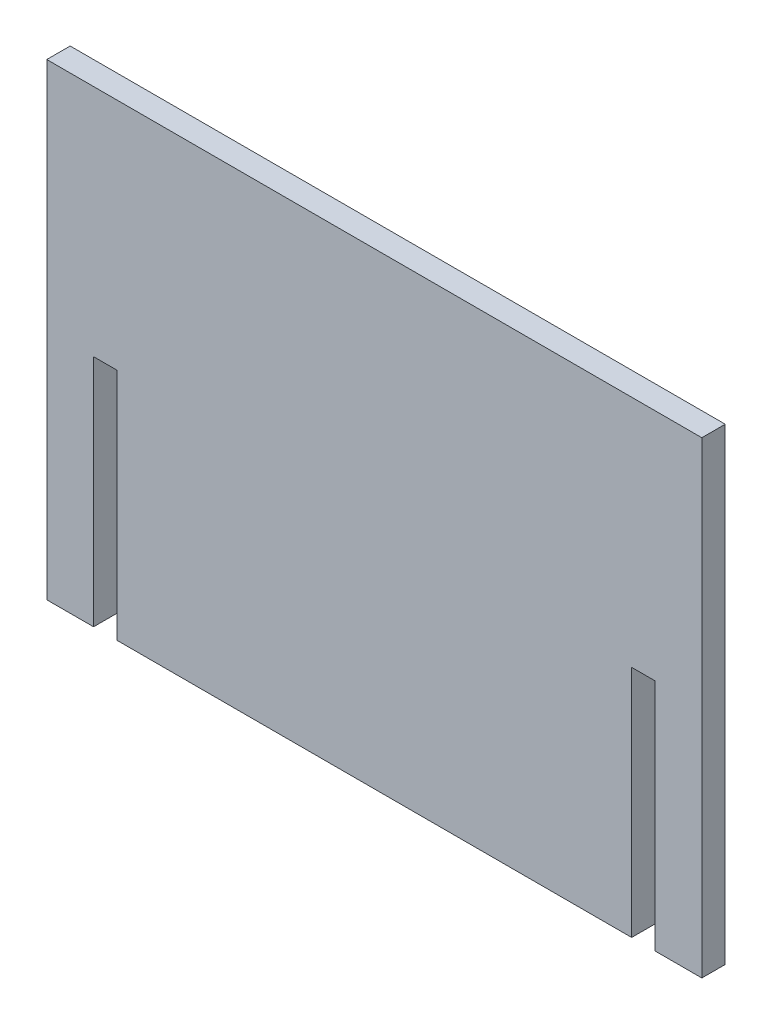
ISO-10303-21;
HEADER;
FILE_DESCRIPTION(('STEP AP214'),'2;1');
FILE_NAME('part.step','',(''),(''),'','','');
FILE_SCHEMA(('AUTOMOTIVE_DESIGN { 1 0 10303 214 1 1 1 1 }'));
ENDSEC;
DATA;
#1=APPLICATION_CONTEXT('core data for automotive mechanical design processes');
#2=APPLICATION_PROTOCOL_DEFINITION('international standard','automotive_design',2000,#1);
#3=PRODUCT_CONTEXT('',#1,'mechanical');
#4=PRODUCT('Part','Part','',(#3));
#5=PRODUCT_RELATED_PRODUCT_CATEGORY('part','',(#4));
#6=PRODUCT_DEFINITION_FORMATION('','',#4);
#7=PRODUCT_DEFINITION_CONTEXT('part definition',#1,'design');
#8=PRODUCT_DEFINITION('design','',#6,#7);
#9=PRODUCT_DEFINITION_SHAPE('','',#8);
#10=(LENGTH_UNIT() NAMED_UNIT(*) SI_UNIT(.MILLI.,.METRE.));
#11=(NAMED_UNIT(*) PLANE_ANGLE_UNIT() SI_UNIT($,.RADIAN.));
#12=(NAMED_UNIT(*) SI_UNIT($,.STERADIAN.) SOLID_ANGLE_UNIT());
#13=UNCERTAINTY_MEASURE_WITH_UNIT(LENGTH_MEASURE(1.E-05),#10,'distance_accuracy_value','');
#14=(GEOMETRIC_REPRESENTATION_CONTEXT(3) GLOBAL_UNCERTAINTY_ASSIGNED_CONTEXT((#13)) GLOBAL_UNIT_ASSIGNED_CONTEXT((#10,
#11,#12)) REPRESENTATION_CONTEXT('',''));
#15=CARTESIAN_POINT('',(0.,0.,0.));
#16=DIRECTION('',(0.,0.,1.));
#17=DIRECTION('',(1.,0.,0.));
#18=AXIS2_PLACEMENT_3D('',#15,#16,#17);
#19=CARTESIAN_POINT('',(1294.20395565763,-24.1798672236195,6.35));
#20=DIRECTION('',(1.,0.,0.));
#21=DIRECTION('',(0.,0.,-1.));
#22=AXIS2_PLACEMENT_3D('',#19,#20,#21);
#23=PLANE('',#22);
#24=DIRECTION('',(0.,-1.,0.));
#25=VECTOR('',#24,1.);
#26=CARTESIAN_POINT('',(1294.20395565763,-24.1798672236195,-6.35));
#27=LINE('',#26,#25);
#28=CARTESIAN_POINT('',(1294.20395565763,-24.1798672236195,-6.35));
#29=VERTEX_POINT('',#28);
#30=CARTESIAN_POINT('',(1294.20395565763,-278.17986722362,-6.35));
#31=VERTEX_POINT('',#30);
#32=EDGE_CURVE('E167',#29,#31,#27,.T.);
#33=ORIENTED_EDGE('',*,*,#32,.T.);
#34=DIRECTION('',(0.,0.,-1.));
#35=VECTOR('',#34,1.);
#36=CARTESIAN_POINT('',(1294.20395565763,-278.17986722362,6.35));
#37=LINE('',#36,#35);
#38=CARTESIAN_POINT('',(1294.20395565763,-278.17986722362,6.35));
#39=VERTEX_POINT('',#38);
#40=EDGE_CURVE('E11',#39,#31,#37,.T.);
#41=ORIENTED_EDGE('',*,*,#40,.F.);
#42=DIRECTION('',(0.,-1.,0.));
#43=VECTOR('',#42,1.);
#44=CARTESIAN_POINT('',(1294.20395565763,-24.1798672236195,6.35));
#45=LINE('',#44,#43);
#46=CARTESIAN_POINT('',(1294.20395565763,-24.1798672236195,6.35));
#47=VERTEX_POINT('',#46);
#48=EDGE_CURVE('E201',#47,#39,#45,.T.);
#49=ORIENTED_EDGE('',*,*,#48,.F.);
#50=DIRECTION('',(0.,0.,-1.));
#51=VECTOR('',#50,1.);
#52=CARTESIAN_POINT('',(1294.20395565763,-24.1798672236195,6.35));
#53=LINE('',#52,#51);
#54=EDGE_CURVE('E163',#47,#29,#53,.T.);
#55=ORIENTED_EDGE('',*,*,#54,.T.);
#56=EDGE_LOOP('',(#33,#41,#49,#55));
#57=FACE_BOUND('',#56,.T.);
#58=ADVANCED_FACE('F42',(#57),#23,.F.);
#59=CARTESIAN_POINT('',(1294.20395565763,-278.17986722362,6.35));
#60=DIRECTION('',(0.,1.,0.));
#61=DIRECTION('',(0.,0.,1.));
#62=AXIS2_PLACEMENT_3D('',#59,#60,#61);
#63=PLANE('',#62);
#64=DIRECTION('',(1.,0.,0.));
#65=VECTOR('',#64,1.);
#66=CARTESIAN_POINT('',(1294.20395565763,-278.17986722362,-6.35));
#67=LINE('',#66,#65);
#68=CARTESIAN_POINT('',(1319.60395565763,-278.17986722362,-6.35));
#69=VERTEX_POINT('',#68);
#70=EDGE_CURVE('E171',#31,#69,#67,.T.);
#71=ORIENTED_EDGE('',*,*,#70,.T.);
#72=DIRECTION('',(0.,0.,-1.));
#73=VECTOR('',#72,1.);
#74=CARTESIAN_POINT('',(1319.60395565763,-278.17986722362,6.35));
#75=LINE('',#74,#73);
#76=CARTESIAN_POINT('',(1319.60395565763,-278.17986722362,6.35));
#77=VERTEX_POINT('',#76);
#78=EDGE_CURVE('E51',#77,#69,#75,.T.);
#79=ORIENTED_EDGE('',*,*,#78,.F.);
#80=DIRECTION('',(1.,0.,0.));
#81=VECTOR('',#80,1.);
#82=CARTESIAN_POINT('',(1294.20395565763,-278.17986722362,6.35));
#83=LINE('',#82,#81);
#84=EDGE_CURVE('E114',#39,#77,#83,.T.);
#85=ORIENTED_EDGE('',*,*,#84,.F.);
#86=ORIENTED_EDGE('',*,*,#40,.T.);
#87=EDGE_LOOP('',(#71,#79,#85,#86));
#88=FACE_BOUND('',#87,.T.);
#89=ADVANCED_FACE('F295',(#88),#63,.F.);
#90=CARTESIAN_POINT('',(1319.60395565763,-278.17986722362,6.35));
#91=DIRECTION('',(-1.,0.,0.));
#92=DIRECTION('',(0.,0.,1.));
#93=AXIS2_PLACEMENT_3D('',#90,#91,#92);
#94=PLANE('',#93);
#95=DIRECTION('',(0.,1.,0.));
#96=VECTOR('',#95,1.);
#97=CARTESIAN_POINT('',(1319.60395565763,-278.17986722362,-6.35));
#98=LINE('',#97,#96);
#99=CARTESIAN_POINT('',(1319.60395565763,-151.17986722362,-6.35));
#100=VERTEX_POINT('',#99);
#101=EDGE_CURVE('E174',#69,#100,#98,.T.);
#102=ORIENTED_EDGE('',*,*,#101,.T.);
#103=DIRECTION('',(0.,0.,-1.));
#104=VECTOR('',#103,1.);
#105=CARTESIAN_POINT('',(1319.60395565763,-151.17986722362,6.35));
#106=LINE('',#105,#104);
#107=CARTESIAN_POINT('',(1319.60395565763,-151.17986722362,6.35));
#108=VERTEX_POINT('',#107);
#109=EDGE_CURVE('E228',#108,#100,#106,.T.);
#110=ORIENTED_EDGE('',*,*,#109,.F.);
#111=DIRECTION('',(0.,1.,0.));
#112=VECTOR('',#111,1.);
#113=CARTESIAN_POINT('',(1319.60395565763,-278.17986722362,6.35));
#114=LINE('',#113,#112);
#115=EDGE_CURVE('E238',#77,#108,#114,.T.);
#116=ORIENTED_EDGE('',*,*,#115,.F.);
#117=ORIENTED_EDGE('',*,*,#78,.T.);
#118=EDGE_LOOP('',(#102,#110,#116,#117));
#119=FACE_BOUND('',#118,.T.);
#120=ADVANCED_FACE('F236',(#119),#94,.F.);
#121=CARTESIAN_POINT('',(1319.60395565763,-151.17986722362,6.35));
#122=DIRECTION('',(0.,1.,0.));
#123=DIRECTION('',(0.,0.,1.));
#124=AXIS2_PLACEMENT_3D('',#121,#122,#123);
#125=PLANE('',#124);
#126=DIRECTION('',(1.,0.,0.));
#127=VECTOR('',#126,1.);
#128=CARTESIAN_POINT('',(1319.60395565763,-151.17986722362,-6.35));
#129=LINE('',#128,#127);
#130=CARTESIAN_POINT('',(1332.30395565763,-151.17986722362,-6.35));
#131=VERTEX_POINT('',#130);
#132=EDGE_CURVE('E177',#100,#131,#129,.T.);
#133=ORIENTED_EDGE('',*,*,#132,.T.);
#134=DIRECTION('',(0.,0.,-1.));
#135=VECTOR('',#134,1.);
#136=CARTESIAN_POINT('',(1332.30395565763,-151.17986722362,6.35));
#137=LINE('',#136,#135);
#138=CARTESIAN_POINT('',(1332.30395565763,-151.17986722362,6.35));
#139=VERTEX_POINT('',#138);
#140=EDGE_CURVE('E224',#139,#131,#137,.T.);
#141=ORIENTED_EDGE('',*,*,#140,.F.);
#142=DIRECTION('',(1.,0.,0.));
#143=VECTOR('',#142,1.);
#144=CARTESIAN_POINT('',(1319.60395565763,-151.17986722362,6.35));
#145=LINE('',#144,#143);
#146=EDGE_CURVE('E257',#108,#139,#145,.T.);
#147=ORIENTED_EDGE('',*,*,#146,.F.);
#148=ORIENTED_EDGE('',*,*,#109,.T.);
#149=EDGE_LOOP('',(#133,#141,#147,#148));
#150=FACE_BOUND('',#149,.T.);
#151=ADVANCED_FACE('F247',(#150),#125,.F.);
#152=CARTESIAN_POINT('',(1332.30395565763,-151.17986722362,6.35));
#153=DIRECTION('',(1.,0.,0.));
#154=DIRECTION('',(0.,0.,-1.));
#155=AXIS2_PLACEMENT_3D('',#152,#153,#154);
#156=PLANE('',#155);
#157=DIRECTION('',(0.,-1.,0.));
#158=VECTOR('',#157,1.);
#159=CARTESIAN_POINT('',(1332.30395565763,-151.17986722362,-6.35));
#160=LINE('',#159,#158);
#161=CARTESIAN_POINT('',(1332.30395565763,-278.17986722362,-6.35));
#162=VERTEX_POINT('',#161);
#163=EDGE_CURVE('E180',#131,#162,#160,.T.);
#164=ORIENTED_EDGE('',*,*,#163,.T.);
#165=DIRECTION('',(0.,0.,-1.));
#166=VECTOR('',#165,1.);
#167=CARTESIAN_POINT('',(1332.30395565763,-278.17986722362,6.35));
#168=LINE('',#167,#166);
#169=CARTESIAN_POINT('',(1332.30395565763,-278.17986722362,6.35));
#170=VERTEX_POINT('',#169);
#171=EDGE_CURVE('E220',#170,#162,#168,.T.);
#172=ORIENTED_EDGE('',*,*,#171,.F.);
#173=DIRECTION('',(0.,-1.,0.));
#174=VECTOR('',#173,1.);
#175=CARTESIAN_POINT('',(1332.30395565763,-151.17986722362,6.35));
#176=LINE('',#175,#174);
#177=EDGE_CURVE('E253',#139,#170,#176,.T.);
#178=ORIENTED_EDGE('',*,*,#177,.F.);
#179=ORIENTED_EDGE('',*,*,#140,.T.);
#180=EDGE_LOOP('',(#164,#172,#178,#179));
#181=FACE_BOUND('',#180,.T.);
#182=ADVANCED_FACE('F251',(#181),#156,.F.);
#183=CARTESIAN_POINT('',(1332.30395565763,-278.17986722362,6.35));
#184=DIRECTION('',(0.,1.,0.));
#185=DIRECTION('',(0.,0.,1.));
#186=AXIS2_PLACEMENT_3D('',#183,#184,#185);
#187=PLANE('',#186);
#188=DIRECTION('',(1.,0.,0.));
#189=VECTOR('',#188,1.);
#190=CARTESIAN_POINT('',(1332.30395565763,-278.17986722362,-6.35));
#191=LINE('',#190,#189);
#192=CARTESIAN_POINT('',(1611.70395565763,-278.17986722362,-6.35));
#193=VERTEX_POINT('',#192);
#194=EDGE_CURVE('E183',#162,#193,#191,.T.);
#195=ORIENTED_EDGE('',*,*,#194,.T.);
#196=DIRECTION('',(0.,0.,-1.));
#197=VECTOR('',#196,1.);
#198=CARTESIAN_POINT('',(1611.70395565763,-278.17986722362,6.35));
#199=LINE('',#198,#197);
#200=CARTESIAN_POINT('',(1611.70395565763,-278.17986722362,6.35));
#201=VERTEX_POINT('',#200);
#202=EDGE_CURVE('E216',#201,#193,#199,.T.);
#203=ORIENTED_EDGE('',*,*,#202,.F.);
#204=DIRECTION('',(1.,0.,0.));
#205=VECTOR('',#204,1.);
#206=CARTESIAN_POINT('',(1332.30395565763,-278.17986722362,6.35));
#207=LINE('',#206,#205);
#208=EDGE_CURVE('E256',#170,#201,#207,.T.);
#209=ORIENTED_EDGE('',*,*,#208,.F.);
#210=ORIENTED_EDGE('',*,*,#171,.T.);
#211=EDGE_LOOP('',(#195,#203,#209,#210));
#212=FACE_BOUND('',#211,.T.);
#213=ADVANCED_FACE('F308',(#212),#187,.F.);
#214=CARTESIAN_POINT('',(1611.70395565763,-278.17986722362,6.35));
#215=DIRECTION('',(-1.,0.,0.));
#216=DIRECTION('',(0.,0.,1.));
#217=AXIS2_PLACEMENT_3D('',#214,#215,#216);
#218=PLANE('',#217);
#219=DIRECTION('',(0.,1.,0.));
#220=VECTOR('',#219,1.);
#221=CARTESIAN_POINT('',(1611.70395565763,-278.17986722362,-6.35));
#222=LINE('',#221,#220);
#223=CARTESIAN_POINT('',(1611.70395565763,-151.17986722362,-6.35));
#224=VERTEX_POINT('',#223);
#225=EDGE_CURVE('E186',#193,#224,#222,.T.);
#226=ORIENTED_EDGE('',*,*,#225,.T.);
#227=DIRECTION('',(0.,0.,-1.));
#228=VECTOR('',#227,1.);
#229=CARTESIAN_POINT('',(1611.70395565763,-151.17986722362,6.35));
#230=LINE('',#229,#228);
#231=CARTESIAN_POINT('',(1611.70395565763,-151.17986722362,6.35));
#232=VERTEX_POINT('',#231);
#233=EDGE_CURVE('E212',#232,#224,#230,.T.);
#234=ORIENTED_EDGE('',*,*,#233,.F.);
#235=DIRECTION('',(0.,1.,0.));
#236=VECTOR('',#235,1.);
#237=CARTESIAN_POINT('',(1611.70395565763,-278.17986722362,6.35));
#238=LINE('',#237,#236);
#239=EDGE_CURVE('E261',#201,#232,#238,.T.);
#240=ORIENTED_EDGE('',*,*,#239,.F.);
#241=ORIENTED_EDGE('',*,*,#202,.T.);
#242=EDGE_LOOP('',(#226,#234,#240,#241));
#243=FACE_BOUND('',#242,.T.);
#244=ADVANCED_FACE('F311',(#243),#218,.F.);
#245=CARTESIAN_POINT('',(1611.70395565763,-151.17986722362,6.35));
#246=DIRECTION('',(0.,1.,0.));
#247=DIRECTION('',(0.,0.,1.));
#248=AXIS2_PLACEMENT_3D('',#245,#246,#247);
#249=PLANE('',#248);
#250=DIRECTION('',(1.,0.,0.));
#251=VECTOR('',#250,1.);
#252=CARTESIAN_POINT('',(1611.70395565763,-151.17986722362,-6.35));
#253=LINE('',#252,#251);
#254=CARTESIAN_POINT('',(1624.40395565763,-151.17986722362,-6.35));
#255=VERTEX_POINT('',#254);
#256=EDGE_CURVE('E189',#224,#255,#253,.T.);
#257=ORIENTED_EDGE('',*,*,#256,.T.);
#258=DIRECTION('',(0.,0.,-1.));
#259=VECTOR('',#258,1.);
#260=CARTESIAN_POINT('',(1624.40395565763,-151.17986722362,6.35));
#261=LINE('',#260,#259);
#262=CARTESIAN_POINT('',(1624.40395565763,-151.17986722362,6.35));
#263=VERTEX_POINT('',#262);
#264=EDGE_CURVE('E208',#263,#255,#261,.T.);
#265=ORIENTED_EDGE('',*,*,#264,.F.);
#266=DIRECTION('',(1.,0.,0.));
#267=VECTOR('',#266,1.);
#268=CARTESIAN_POINT('',(1611.70395565763,-151.17986722362,6.35));
#269=LINE('',#268,#267);
#270=EDGE_CURVE('E268',#232,#263,#269,.T.);
#271=ORIENTED_EDGE('',*,*,#270,.F.);
#272=ORIENTED_EDGE('',*,*,#233,.T.);
#273=EDGE_LOOP('',(#257,#265,#271,#272));
#274=FACE_BOUND('',#273,.T.);
#275=ADVANCED_FACE('F276',(#274),#249,.F.);
#276=CARTESIAN_POINT('',(1624.40395565763,-151.17986722362,6.35));
#277=DIRECTION('',(1.,0.,0.));
#278=DIRECTION('',(0.,0.,-1.));
#279=AXIS2_PLACEMENT_3D('',#276,#277,#278);
#280=PLANE('',#279);
#281=DIRECTION('',(0.,-1.,0.));
#282=VECTOR('',#281,1.);
#283=CARTESIAN_POINT('',(1624.40395565763,-151.17986722362,-6.35));
#284=LINE('',#283,#282);
#285=CARTESIAN_POINT('',(1624.40395565763,-278.17986722362,-6.35));
#286=VERTEX_POINT('',#285);
#287=EDGE_CURVE('E192',#255,#286,#284,.T.);
#288=ORIENTED_EDGE('',*,*,#287,.T.);
#289=DIRECTION('',(0.,0.,-1.));
#290=VECTOR('',#289,1.);
#291=CARTESIAN_POINT('',(1624.40395565763,-278.17986722362,6.35));
#292=LINE('',#291,#290);
#293=CARTESIAN_POINT('',(1624.40395565763,-278.17986722362,6.35));
#294=VERTEX_POINT('',#293);
#295=EDGE_CURVE('E156',#294,#286,#292,.T.);
#296=ORIENTED_EDGE('',*,*,#295,.F.);
#297=DIRECTION('',(0.,-1.,0.));
#298=VECTOR('',#297,1.);
#299=CARTESIAN_POINT('',(1624.40395565763,-151.17986722362,6.35));
#300=LINE('',#299,#298);
#301=EDGE_CURVE('E145',#263,#294,#300,.T.);
#302=ORIENTED_EDGE('',*,*,#301,.F.);
#303=ORIENTED_EDGE('',*,*,#264,.T.);
#304=EDGE_LOOP('',(#288,#296,#302,#303));
#305=FACE_BOUND('',#304,.T.);
#306=ADVANCED_FACE('F280',(#305),#280,.F.);
#307=CARTESIAN_POINT('',(1624.40395565763,-278.17986722362,6.35));
#308=DIRECTION('',(0.,1.,0.));
#309=DIRECTION('',(0.,0.,1.));
#310=AXIS2_PLACEMENT_3D('',#307,#308,#309);
#311=PLANE('',#310);
#312=DIRECTION('',(1.,0.,0.));
#313=VECTOR('',#312,1.);
#314=CARTESIAN_POINT('',(1624.40395565763,-278.17986722362,-6.35));
#315=LINE('',#314,#313);
#316=CARTESIAN_POINT('',(1649.80395565763,-278.17986722362,-6.35));
#317=VERTEX_POINT('',#316);
#318=EDGE_CURVE('E154',#286,#317,#315,.T.);
#319=ORIENTED_EDGE('',*,*,#318,.T.);
#320=DIRECTION('',(0.,0.,-1.));
#321=VECTOR('',#320,1.);
#322=CARTESIAN_POINT('',(1649.80395565763,-278.17986722362,6.35));
#323=LINE('',#322,#321);
#324=CARTESIAN_POINT('',(1649.80395565763,-278.17986722362,6.35));
#325=VERTEX_POINT('',#324);
#326=EDGE_CURVE('E151',#325,#317,#323,.T.);
#327=ORIENTED_EDGE('',*,*,#326,.F.);
#328=DIRECTION('',(1.,0.,0.));
#329=VECTOR('',#328,1.);
#330=CARTESIAN_POINT('',(1624.40395565763,-278.17986722362,6.35));
#331=LINE('',#330,#329);
#332=EDGE_CURVE('E139',#294,#325,#331,.T.);
#333=ORIENTED_EDGE('',*,*,#332,.F.);
#334=ORIENTED_EDGE('',*,*,#295,.T.);
#335=EDGE_LOOP('',(#319,#327,#333,#334));
#336=FACE_BOUND('',#335,.T.);
#337=ADVANCED_FACE('F152',(#336),#311,.F.);
#338=CARTESIAN_POINT('',(1649.80395565763,-24.1798672236195,6.35));
#339=DIRECTION('',(-1.,0.,0.));
#340=DIRECTION('',(0.,0.,1.));
#341=AXIS2_PLACEMENT_3D('',#338,#339,#340);
#342=PLANE('',#341);
#343=DIRECTION('',(0.,1.,0.));
#344=VECTOR('',#343,1.);
#345=CARTESIAN_POINT('',(1649.80395565763,-24.1798672236195,-6.35));
#346=LINE('',#345,#344);
#347=CARTESIAN_POINT('',(1649.80395565763,-24.1798672236195,-6.35));
#348=VERTEX_POINT('',#347);
#349=EDGE_CURVE('E100',#317,#348,#346,.T.);
#350=ORIENTED_EDGE('',*,*,#349,.T.);
#351=DIRECTION('',(0.,0.,-1.));
#352=VECTOR('',#351,1.);
#353=CARTESIAN_POINT('',(1649.80395565763,-24.1798672236195,6.35));
#354=LINE('',#353,#352);
#355=CARTESIAN_POINT('',(1649.80395565763,-24.1798672236195,6.35));
#356=VERTEX_POINT('',#355);
#357=EDGE_CURVE('E157',#356,#348,#354,.T.);
#358=ORIENTED_EDGE('',*,*,#357,.F.);
#359=DIRECTION('',(0.,1.,0.));
#360=VECTOR('',#359,1.);
#361=CARTESIAN_POINT('',(1649.80395565763,-24.1798672236195,6.35));
#362=LINE('',#361,#360);
#363=EDGE_CURVE('E143',#325,#356,#362,.T.);
#364=ORIENTED_EDGE('',*,*,#363,.F.);
#365=ORIENTED_EDGE('',*,*,#326,.T.);
#366=EDGE_LOOP('',(#350,#358,#364,#365));
#367=FACE_BOUND('',#366,.T.);
#368=ADVANCED_FACE('F159',(#367),#342,.F.);
#369=CARTESIAN_POINT('',(1294.20395565763,-24.1798672236195,6.35));
#370=DIRECTION('',(0.,-1.,0.));
#371=DIRECTION('',(0.,0.,-1.));
#372=AXIS2_PLACEMENT_3D('',#369,#370,#371);
#373=PLANE('',#372);
#374=DIRECTION('',(-1.,0.,0.));
#375=VECTOR('',#374,1.);
#376=CARTESIAN_POINT('',(1294.20395565763,-24.1798672236195,-6.35));
#377=LINE('',#376,#375);
#378=EDGE_CURVE('E106',#348,#29,#377,.T.);
#379=ORIENTED_EDGE('',*,*,#378,.T.);
#380=ORIENTED_EDGE('',*,*,#54,.F.);
#381=DIRECTION('',(-1.,0.,0.));
#382=VECTOR('',#381,1.);
#383=CARTESIAN_POINT('',(1294.20395565763,-24.1798672236195,6.35));
#384=LINE('',#383,#382);
#385=EDGE_CURVE('E59',#356,#47,#384,.T.);
#386=ORIENTED_EDGE('',*,*,#385,.F.);
#387=ORIENTED_EDGE('',*,*,#357,.T.);
#388=EDGE_LOOP('',(#379,#380,#386,#387));
#389=FACE_BOUND('',#388,.T.);
#390=ADVANCED_FACE('F284',(#389),#373,.F.);
#391=CARTESIAN_POINT('',(0.,0.,6.35));
#392=DIRECTION('',(0.,0.,1.));
#393=DIRECTION('',(1.,0.,0.));
#394=AXIS2_PLACEMENT_3D('',#391,#392,#393);
#395=PLANE('',#394);
#396=ORIENTED_EDGE('',*,*,#48,.T.);
#397=ORIENTED_EDGE('',*,*,#84,.T.);
#398=ORIENTED_EDGE('',*,*,#115,.T.);
#399=ORIENTED_EDGE('',*,*,#146,.T.);
#400=ORIENTED_EDGE('',*,*,#177,.T.);
#401=ORIENTED_EDGE('',*,*,#208,.T.);
#402=ORIENTED_EDGE('',*,*,#239,.T.);
#403=ORIENTED_EDGE('',*,*,#270,.T.);
#404=ORIENTED_EDGE('',*,*,#301,.T.);
#405=ORIENTED_EDGE('',*,*,#332,.T.);
#406=ORIENTED_EDGE('',*,*,#363,.T.);
#407=ORIENTED_EDGE('',*,*,#385,.T.);
#408=EDGE_LOOP('',(#396,#397,#398,#399,#400,#401,#402,#403,#404,#405,#406,#407));
#409=FACE_BOUND('',#408,.T.);
#410=ADVANCED_FACE('F141',(#409),#395,.T.);
#411=CARTESIAN_POINT('',(0.,0.,-6.35));
#412=DIRECTION('',(0.,0.,1.));
#413=DIRECTION('',(1.,0.,0.));
#414=AXIS2_PLACEMENT_3D('',#411,#412,#413);
#415=PLANE('',#414);
#416=ORIENTED_EDGE('',*,*,#32,.F.);
#417=ORIENTED_EDGE('',*,*,#378,.F.);
#418=ORIENTED_EDGE('',*,*,#349,.F.);
#419=ORIENTED_EDGE('',*,*,#318,.F.);
#420=ORIENTED_EDGE('',*,*,#287,.F.);
#421=ORIENTED_EDGE('',*,*,#256,.F.);
#422=ORIENTED_EDGE('',*,*,#225,.F.);
#423=ORIENTED_EDGE('',*,*,#194,.F.);
#424=ORIENTED_EDGE('',*,*,#163,.F.);
#425=ORIENTED_EDGE('',*,*,#132,.F.);
#426=ORIENTED_EDGE('',*,*,#101,.F.);
#427=ORIENTED_EDGE('',*,*,#70,.F.);
#428=EDGE_LOOP('',(#416,#417,#418,#419,#420,#421,#422,#423,#424,#425,#426,#427));
#429=FACE_BOUND('',#428,.T.);
#430=ADVANCED_FACE('F242',(#429),#415,.F.);
#431=CLOSED_SHELL('',(#58,#89,#120,#151,#182,#213,#244,#275,#306,#337,#368,#390,#410,#430));
#432=MANIFOLD_SOLID_BREP('B2',#431);
#433=ADVANCED_BREP_SHAPE_REPRESENTATION('',(#18,#432),#14);
#434=SHAPE_DEFINITION_REPRESENTATION(#9,#433);
ENDSEC;
END-ISO-10303-21;
